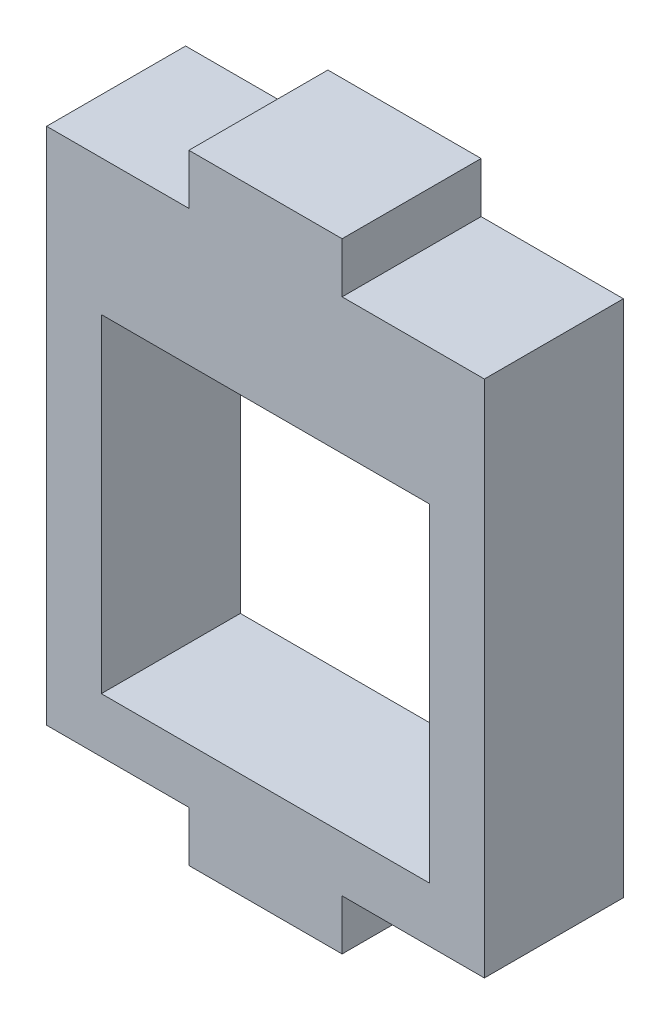
ISO-10303-21;
HEADER;
FILE_DESCRIPTION(('STEP AP214'),'2;1');
FILE_NAME('part.step','',(''),(''),'','','');
FILE_SCHEMA(('AUTOMOTIVE_DESIGN { 1 0 10303 214 1 1 1 1 }'));
ENDSEC;
DATA;
#1=APPLICATION_CONTEXT('core data for automotive mechanical design processes');
#2=APPLICATION_PROTOCOL_DEFINITION('international standard','automotive_design',2000,#1);
#3=PRODUCT_CONTEXT('',#1,'mechanical');
#4=PRODUCT('Part','Part','',(#3));
#5=PRODUCT_RELATED_PRODUCT_CATEGORY('part','',(#4));
#6=PRODUCT_DEFINITION_FORMATION('','',#4);
#7=PRODUCT_DEFINITION_CONTEXT('part definition',#1,'design');
#8=PRODUCT_DEFINITION('design','',#6,#7);
#9=PRODUCT_DEFINITION_SHAPE('','',#8);
#10=(LENGTH_UNIT() NAMED_UNIT(*) SI_UNIT(.MILLI.,.METRE.));
#11=(NAMED_UNIT(*) PLANE_ANGLE_UNIT() SI_UNIT($,.RADIAN.));
#12=(NAMED_UNIT(*) SI_UNIT($,.STERADIAN.) SOLID_ANGLE_UNIT());
#13=UNCERTAINTY_MEASURE_WITH_UNIT(LENGTH_MEASURE(1.E-05),#10,'distance_accuracy_value','');
#14=(GEOMETRIC_REPRESENTATION_CONTEXT(3) GLOBAL_UNCERTAINTY_ASSIGNED_CONTEXT((#13)) GLOBAL_UNIT_ASSIGNED_CONTEXT((#10,
#11,#12)) REPRESENTATION_CONTEXT('',''));
#15=CARTESIAN_POINT('',(0.,0.,0.));
#16=DIRECTION('',(0.,0.,1.));
#17=DIRECTION('',(1.,0.,0.));
#18=AXIS2_PLACEMENT_3D('',#15,#16,#17);
#19=CARTESIAN_POINT('',(2.26470070803342,0.383619426620352,6.35));
#20=DIRECTION('',(0.,1.,0.));
#21=DIRECTION('',(-1.,0.,0.));
#22=AXIS2_PLACEMENT_3D('',#19,#20,#21);
#23=PLANE('',#22);
#24=DIRECTION('',(0.,0.,1.));
#25=VECTOR('',#24,1.);
#26=CARTESIAN_POINT('',(-4.23529929196658,0.383619426620351,0.));
#27=LINE('',#26,#25);
#28=CARTESIAN_POINT('',(-4.23529929196658,0.383619426620351,0.));
#29=VERTEX_POINT('',#28);
#30=CARTESIAN_POINT('',(-4.23529929196658,0.383619426620351,6.35));
#31=VERTEX_POINT('',#30);
#32=EDGE_CURVE('E361',#29,#31,#27,.T.);
#33=ORIENTED_EDGE('',*,*,#32,.F.);
#34=DIRECTION('',(1.,0.,0.));
#35=VECTOR('',#34,1.);
#36=CARTESIAN_POINT('',(2.26470070803342,0.383619426620352,0.));
#37=LINE('',#36,#35);
#38=CARTESIAN_POINT('',(2.26470070803342,0.383619426620352,0.));
#39=VERTEX_POINT('',#38);
#40=EDGE_CURVE('E143',#29,#39,#37,.T.);
#41=ORIENTED_EDGE('',*,*,#40,.T.);
#42=DIRECTION('',(0.,0.,-1.));
#43=VECTOR('',#42,1.);
#44=CARTESIAN_POINT('',(2.26470070803342,0.383619426620352,6.35));
#45=LINE('',#44,#43);
#46=CARTESIAN_POINT('',(2.26470070803342,0.383619426620352,6.35));
#47=VERTEX_POINT('',#46);
#48=EDGE_CURVE('E48',#47,#39,#45,.T.);
#49=ORIENTED_EDGE('',*,*,#48,.F.);
#50=DIRECTION('',(1.,0.,0.));
#51=VECTOR('',#50,1.);
#52=CARTESIAN_POINT('',(2.26470070803342,0.383619426620352,6.35));
#53=LINE('',#52,#51);
#54=EDGE_CURVE('E266',#31,#47,#53,.T.);
#55=ORIENTED_EDGE('',*,*,#54,.F.);
#56=EDGE_LOOP('',(#33,#41,#49,#55));
#57=FACE_BOUND('',#56,.T.);
#58=ADVANCED_FACE('F39',(#57),#23,.F.);
#59=CARTESIAN_POINT('',(-17.7352992919666,0.383619426620351,6.35));
#60=DIRECTION('',(1.,0.,0.));
#61=DIRECTION('',(0.,0.,-1.));
#62=AXIS2_PLACEMENT_3D('',#59,#60,#61);
#63=PLANE('',#62);
#64=DIRECTION('',(0.,-1.,0.));
#65=VECTOR('',#64,1.);
#66=CARTESIAN_POINT('',(-17.7352992919666,0.383619426620351,0.));
#67=LINE('',#66,#65);
#68=CARTESIAN_POINT('',(-17.7352992919666,24.0836194266204,0.));
#69=VERTEX_POINT('',#68);
#70=CARTESIAN_POINT('',(-17.7352992919666,0.383619426620351,0.));
#71=VERTEX_POINT('',#70);
#72=EDGE_CURVE('E140',#69,#71,#67,.T.);
#73=ORIENTED_EDGE('',*,*,#72,.T.);
#74=DIRECTION('',(0.,0.,-1.));
#75=VECTOR('',#74,1.);
#76=CARTESIAN_POINT('',(-17.7352992919666,0.383619426620351,6.35));
#77=LINE('',#76,#75);
#78=CARTESIAN_POINT('',(-17.7352992919666,0.383619426620351,6.35));
#79=VERTEX_POINT('',#78);
#80=EDGE_CURVE('E11',#79,#71,#77,.T.);
#81=ORIENTED_EDGE('',*,*,#80,.F.);
#82=DIRECTION('',(0.,-1.,0.));
#83=VECTOR('',#82,1.);
#84=CARTESIAN_POINT('',(-17.7352992919666,0.383619426620351,6.35));
#85=LINE('',#84,#83);
#86=CARTESIAN_POINT('',(-17.7352992919666,24.0836194266204,6.35));
#87=VERTEX_POINT('',#86);
#88=EDGE_CURVE('E97',#87,#79,#85,.T.);
#89=ORIENTED_EDGE('',*,*,#88,.F.);
#90=DIRECTION('',(0.,0.,1.));
#91=VECTOR('',#90,1.);
#92=CARTESIAN_POINT('',(-17.7352992919666,24.0836194266204,0.));
#93=LINE('',#92,#91);
#94=EDGE_CURVE('E237',#69,#87,#93,.T.);
#95=ORIENTED_EDGE('',*,*,#94,.F.);
#96=EDGE_LOOP('',(#73,#81,#89,#95));
#97=FACE_BOUND('',#96,.T.);
#98=ADVANCED_FACE('F41',(#97),#63,.F.);
#99=CARTESIAN_POINT('',(-11.2352992919666,0.383619426620351,0.));
#100=VERTEX_POINT('',#99);
#101=EDGE_CURVE('E144',#71,#100,#37,.T.);
#102=ORIENTED_EDGE('',*,*,#101,.T.);
#103=DIRECTION('',(0.,0.,1.));
#104=VECTOR('',#103,1.);
#105=CARTESIAN_POINT('',(-11.2352992919666,0.383619426620351,0.));
#106=LINE('',#105,#104);
#107=CARTESIAN_POINT('',(-11.2352992919666,0.383619426620351,6.35));
#108=VERTEX_POINT('',#107);
#109=EDGE_CURVE('E226',#100,#108,#106,.T.);
#110=ORIENTED_EDGE('',*,*,#109,.T.);
#111=EDGE_CURVE('E267',#79,#108,#53,.T.);
#112=ORIENTED_EDGE('',*,*,#111,.F.);
#113=ORIENTED_EDGE('',*,*,#80,.T.);
#114=EDGE_LOOP('',(#102,#110,#112,#113));
#115=FACE_BOUND('',#114,.T.);
#116=ADVANCED_FACE('F369',(#115),#23,.F.);
#117=CARTESIAN_POINT('',(2.26470070803342,17.8836194266204,6.35));
#118=DIRECTION('',(-1.,0.,0.));
#119=DIRECTION('',(0.,-1.,0.));
#120=AXIS2_PLACEMENT_3D('',#117,#118,#119);
#121=PLANE('',#120);
#122=DIRECTION('',(0.,1.,0.));
#123=VECTOR('',#122,1.);
#124=CARTESIAN_POINT('',(2.26470070803342,17.8836194266204,0.));
#125=LINE('',#124,#123);
#126=CARTESIAN_POINT('',(2.26470070803342,24.0836194266204,0.));
#127=VERTEX_POINT('',#126);
#128=EDGE_CURVE('E148',#39,#127,#125,.T.);
#129=ORIENTED_EDGE('',*,*,#128,.T.);
#130=DIRECTION('',(0.,0.,1.));
#131=VECTOR('',#130,1.);
#132=CARTESIAN_POINT('',(2.26470070803342,24.0836194266204,0.));
#133=LINE('',#132,#131);
#134=CARTESIAN_POINT('',(2.26470070803342,24.0836194266204,6.35));
#135=VERTEX_POINT('',#134);
#136=EDGE_CURVE('E220',#127,#135,#133,.T.);
#137=ORIENTED_EDGE('',*,*,#136,.T.);
#138=DIRECTION('',(0.,1.,0.));
#139=VECTOR('',#138,1.);
#140=CARTESIAN_POINT('',(2.26470070803342,17.8836194266204,6.35));
#141=LINE('',#140,#139);
#142=EDGE_CURVE('E119',#47,#135,#141,.T.);
#143=ORIENTED_EDGE('',*,*,#142,.F.);
#144=ORIENTED_EDGE('',*,*,#48,.T.);
#145=EDGE_LOOP('',(#129,#137,#143,#144));
#146=FACE_BOUND('',#145,.T.);
#147=ADVANCED_FACE('F170',(#146),#121,.F.);
#148=CARTESIAN_POINT('',(-0.235299291966581,2.88361942662035,6.35));
#149=DIRECTION('',(1.,0.,0.));
#150=DIRECTION('',(0.,0.,-1.));
#151=AXIS2_PLACEMENT_3D('',#148,#149,#150);
#152=PLANE('',#151);
#153=DIRECTION('',(0.,-1.,0.));
#154=VECTOR('',#153,1.);
#155=CARTESIAN_POINT('',(-0.235299291966581,2.88361942662035,0.));
#156=LINE('',#155,#154);
#157=CARTESIAN_POINT('',(-0.235299291966581,17.8836194266204,0.));
#158=VERTEX_POINT('',#157);
#159=CARTESIAN_POINT('',(-0.235299291966581,2.88361942662035,0.));
#160=VERTEX_POINT('',#159);
#161=EDGE_CURVE('E125',#158,#160,#156,.T.);
#162=ORIENTED_EDGE('',*,*,#161,.T.);
#163=DIRECTION('',(0.,0.,-1.));
#164=VECTOR('',#163,1.);
#165=CARTESIAN_POINT('',(-0.235299291966581,2.88361942662035,6.35));
#166=LINE('',#165,#164);
#167=CARTESIAN_POINT('',(-0.235299291966581,2.88361942662035,6.35));
#168=VERTEX_POINT('',#167);
#169=EDGE_CURVE('E122',#168,#160,#166,.T.);
#170=ORIENTED_EDGE('',*,*,#169,.F.);
#171=DIRECTION('',(0.,-1.,0.));
#172=VECTOR('',#171,1.);
#173=CARTESIAN_POINT('',(-0.235299291966581,2.88361942662035,6.35));
#174=LINE('',#173,#172);
#175=CARTESIAN_POINT('',(-0.235299291966581,17.8836194266204,6.35));
#176=VERTEX_POINT('',#175);
#177=EDGE_CURVE('E107',#176,#168,#174,.T.);
#178=ORIENTED_EDGE('',*,*,#177,.F.);
#179=DIRECTION('',(0.,0.,-1.));
#180=VECTOR('',#179,1.);
#181=CARTESIAN_POINT('',(-0.235299291966581,17.8836194266204,6.35));
#182=LINE('',#181,#180);
#183=EDGE_CURVE('E129',#176,#158,#182,.T.);
#184=ORIENTED_EDGE('',*,*,#183,.T.);
#185=EDGE_LOOP('',(#162,#170,#178,#184));
#186=FACE_BOUND('',#185,.T.);
#187=ADVANCED_FACE('F123',(#186),#152,.F.);
#188=CARTESIAN_POINT('',(-15.2352992919666,2.88361942662035,6.35));
#189=DIRECTION('',(0.,-1.,0.));
#190=DIRECTION('',(1.,0.,0.));
#191=AXIS2_PLACEMENT_3D('',#188,#189,#190);
#192=PLANE('',#191);
#193=DIRECTION('',(-1.,0.,0.));
#194=VECTOR('',#193,1.);
#195=CARTESIAN_POINT('',(-15.2352992919666,2.88361942662035,0.));
#196=LINE('',#195,#194);
#197=CARTESIAN_POINT('',(-15.2352992919666,2.88361942662035,0.));
#198=VERTEX_POINT('',#197);
#199=EDGE_CURVE('E154',#160,#198,#196,.T.);
#200=ORIENTED_EDGE('',*,*,#199,.T.);
#201=DIRECTION('',(0.,0.,-1.));
#202=VECTOR('',#201,1.);
#203=CARTESIAN_POINT('',(-15.2352992919666,2.88361942662035,6.35));
#204=LINE('',#203,#202);
#205=CARTESIAN_POINT('',(-15.2352992919666,2.88361942662035,6.35));
#206=VERTEX_POINT('',#205);
#207=EDGE_CURVE('E130',#206,#198,#204,.T.);
#208=ORIENTED_EDGE('',*,*,#207,.F.);
#209=DIRECTION('',(-1.,0.,0.));
#210=VECTOR('',#209,1.);
#211=CARTESIAN_POINT('',(-15.2352992919666,2.88361942662035,6.35));
#212=LINE('',#211,#210);
#213=EDGE_CURVE('E111',#168,#206,#212,.T.);
#214=ORIENTED_EDGE('',*,*,#213,.F.);
#215=ORIENTED_EDGE('',*,*,#169,.T.);
#216=EDGE_LOOP('',(#200,#208,#214,#215));
#217=FACE_BOUND('',#216,.T.);
#218=ADVANCED_FACE('F132',(#217),#192,.F.);
#219=CARTESIAN_POINT('',(-15.2352992919666,17.8836194266204,6.35));
#220=DIRECTION('',(-1.,0.,0.));
#221=DIRECTION('',(0.,-1.,0.));
#222=AXIS2_PLACEMENT_3D('',#219,#220,#221);
#223=PLANE('',#222);
#224=DIRECTION('',(0.,1.,0.));
#225=VECTOR('',#224,1.);
#226=CARTESIAN_POINT('',(-15.2352992919666,17.8836194266204,0.));
#227=LINE('',#226,#225);
#228=CARTESIAN_POINT('',(-15.2352992919666,17.8836194266204,0.));
#229=VERTEX_POINT('',#228);
#230=EDGE_CURVE('E88',#198,#229,#227,.T.);
#231=ORIENTED_EDGE('',*,*,#230,.T.);
#232=DIRECTION('',(0.,0.,-1.));
#233=VECTOR('',#232,1.);
#234=CARTESIAN_POINT('',(-15.2352992919666,17.8836194266204,6.35));
#235=LINE('',#234,#233);
#236=CARTESIAN_POINT('',(-15.2352992919666,17.8836194266204,6.35));
#237=VERTEX_POINT('',#236);
#238=EDGE_CURVE('E136',#237,#229,#235,.T.);
#239=ORIENTED_EDGE('',*,*,#238,.F.);
#240=DIRECTION('',(0.,1.,0.));
#241=VECTOR('',#240,1.);
#242=CARTESIAN_POINT('',(-15.2352992919666,17.8836194266204,6.35));
#243=LINE('',#242,#241);
#244=EDGE_CURVE('E64',#206,#237,#243,.T.);
#245=ORIENTED_EDGE('',*,*,#244,.F.);
#246=ORIENTED_EDGE('',*,*,#207,.T.);
#247=EDGE_LOOP('',(#231,#239,#245,#246));
#248=FACE_BOUND('',#247,.T.);
#249=ADVANCED_FACE('F399',(#248),#223,.F.);
#250=CARTESIAN_POINT('',(0.,0.,6.35));
#251=DIRECTION('',(0.,0.,-1.));
#252=DIRECTION('',(-1.,0.,0.));
#253=AXIS2_PLACEMENT_3D('',#250,#251,#252);
#254=PLANE('',#253);
#255=ORIENTED_EDGE('',*,*,#142,.T.);
#256=DIRECTION('',(-1.,0.,0.));
#257=VECTOR('',#256,1.);
#258=CARTESIAN_POINT('',(-4.23529929196658,24.0836194266204,6.35));
#259=LINE('',#258,#257);
#260=CARTESIAN_POINT('',(-4.23529929196658,24.0836194266204,6.35));
#261=VERTEX_POINT('',#260);
#262=EDGE_CURVE('E221',#135,#261,#259,.T.);
#263=ORIENTED_EDGE('',*,*,#262,.T.);
#264=DIRECTION('',(0.,1.,0.));
#265=VECTOR('',#264,1.);
#266=CARTESIAN_POINT('',(-4.23529929196658,24.0836194266204,6.35));
#267=LINE('',#266,#265);
#268=CARTESIAN_POINT('',(-4.23529929196658,26.3836194266203,6.35));
#269=VERTEX_POINT('',#268);
#270=EDGE_CURVE('E225',#261,#269,#267,.T.);
#271=ORIENTED_EDGE('',*,*,#270,.T.);
#272=DIRECTION('',(-1.,0.,0.));
#273=VECTOR('',#272,1.);
#274=CARTESIAN_POINT('',(-11.2352992919666,26.3836194266203,6.35));
#275=LINE('',#274,#273);
#276=CARTESIAN_POINT('',(-11.2352992919666,26.3836194266203,6.35));
#277=VERTEX_POINT('',#276);
#278=EDGE_CURVE('E230',#269,#277,#275,.T.);
#279=ORIENTED_EDGE('',*,*,#278,.T.);
#280=DIRECTION('',(0.,-1.,0.));
#281=VECTOR('',#280,1.);
#282=CARTESIAN_POINT('',(-11.2352992919666,24.0836194266204,6.35));
#283=LINE('',#282,#281);
#284=CARTESIAN_POINT('',(-11.2352992919666,24.0836194266204,6.35));
#285=VERTEX_POINT('',#284);
#286=EDGE_CURVE('E203',#277,#285,#283,.T.);
#287=ORIENTED_EDGE('',*,*,#286,.T.);
#288=DIRECTION('',(-1.,0.,0.));
#289=VECTOR('',#288,1.);
#290=CARTESIAN_POINT('',(-17.7352992919666,24.0836194266204,6.35));
#291=LINE('',#290,#289);
#292=EDGE_CURVE('E197',#285,#87,#291,.T.);
#293=ORIENTED_EDGE('',*,*,#292,.T.);
#294=ORIENTED_EDGE('',*,*,#88,.T.);
#295=ORIENTED_EDGE('',*,*,#111,.T.);
#296=DIRECTION('',(0.,-1.,0.));
#297=VECTOR('',#296,1.);
#298=CARTESIAN_POINT('',(-11.2352992919666,0.383619426620351,6.35));
#299=LINE('',#298,#297);
#300=CARTESIAN_POINT('',(-11.2352992919666,-1.91638057337965,6.35));
#301=VERTEX_POINT('',#300);
#302=EDGE_CURVE('E55',#108,#301,#299,.T.);
#303=ORIENTED_EDGE('',*,*,#302,.T.);
#304=DIRECTION('',(1.,0.,0.));
#305=VECTOR('',#304,1.);
#306=CARTESIAN_POINT('',(-11.2352992919666,-1.91638057337965,6.35));
#307=LINE('',#306,#305);
#308=CARTESIAN_POINT('',(-4.23529929196658,-1.91638057337965,6.35));
#309=VERTEX_POINT('',#308);
#310=EDGE_CURVE('E336',#301,#309,#307,.T.);
#311=ORIENTED_EDGE('',*,*,#310,.T.);
#312=DIRECTION('',(0.,1.,0.));
#313=VECTOR('',#312,1.);
#314=CARTESIAN_POINT('',(-4.23529929196658,0.383619426620351,6.35));
#315=LINE('',#314,#313);
#316=EDGE_CURVE('E348',#309,#31,#315,.T.);
#317=ORIENTED_EDGE('',*,*,#316,.T.);
#318=ORIENTED_EDGE('',*,*,#54,.T.);
#319=EDGE_LOOP('',(#255,#263,#271,#279,#287,#293,#294,#295,#303,#311,#317,#318));
#320=FACE_BOUND('',#319,.T.);
#321=ORIENTED_EDGE('',*,*,#244,.T.);
#322=DIRECTION('',(1.,0.,0.));
#323=VECTOR('',#322,1.);
#324=CARTESIAN_POINT('',(-17.7352992919666,17.8836194266204,6.35));
#325=LINE('',#324,#323);
#326=EDGE_CURVE('E114',#237,#176,#325,.T.);
#327=ORIENTED_EDGE('',*,*,#326,.T.);
#328=ORIENTED_EDGE('',*,*,#177,.T.);
#329=ORIENTED_EDGE('',*,*,#213,.T.);
#330=EDGE_LOOP('',(#321,#327,#328,#329));
#331=FACE_BOUND('',#330,.T.);
#332=ADVANCED_FACE('F109',(#320,#331),#254,.F.);
#333=CARTESIAN_POINT('',(0.,0.,0.));
#334=DIRECTION('',(0.,0.,-1.));
#335=DIRECTION('',(-1.,0.,0.));
#336=AXIS2_PLACEMENT_3D('',#333,#334,#335);
#337=PLANE('',#336);
#338=ORIENTED_EDGE('',*,*,#72,.F.);
#339=DIRECTION('',(-1.,0.,0.));
#340=VECTOR('',#339,1.);
#341=CARTESIAN_POINT('',(-17.7352992919666,24.0836194266204,0.));
#342=LINE('',#341,#340);
#343=CARTESIAN_POINT('',(-11.2352992919666,24.0836194266204,0.));
#344=VERTEX_POINT('',#343);
#345=EDGE_CURVE('E216',#344,#69,#342,.T.);
#346=ORIENTED_EDGE('',*,*,#345,.F.);
#347=DIRECTION('',(0.,-1.,0.));
#348=VECTOR('',#347,1.);
#349=CARTESIAN_POINT('',(-11.2352992919666,24.0836194266204,0.));
#350=LINE('',#349,#348);
#351=CARTESIAN_POINT('',(-11.2352992919666,26.3836194266203,0.));
#352=VERTEX_POINT('',#351);
#353=EDGE_CURVE('E212',#352,#344,#350,.T.);
#354=ORIENTED_EDGE('',*,*,#353,.F.);
#355=DIRECTION('',(-1.,0.,0.));
#356=VECTOR('',#355,1.);
#357=CARTESIAN_POINT('',(-11.2352992919666,26.3836194266203,0.));
#358=LINE('',#357,#356);
#359=CARTESIAN_POINT('',(-4.23529929196658,26.3836194266203,0.));
#360=VERTEX_POINT('',#359);
#361=EDGE_CURVE('E201',#360,#352,#358,.T.);
#362=ORIENTED_EDGE('',*,*,#361,.F.);
#363=DIRECTION('',(0.,1.,0.));
#364=VECTOR('',#363,1.);
#365=CARTESIAN_POINT('',(-4.23529929196658,24.0836194266204,0.));
#366=LINE('',#365,#364);
#367=CARTESIAN_POINT('',(-4.23529929196658,24.0836194266204,0.));
#368=VERTEX_POINT('',#367);
#369=EDGE_CURVE('E191',#368,#360,#366,.T.);
#370=ORIENTED_EDGE('',*,*,#369,.F.);
#371=DIRECTION('',(-1.,0.,0.));
#372=VECTOR('',#371,1.);
#373=CARTESIAN_POINT('',(-4.23529929196658,24.0836194266204,0.));
#374=LINE('',#373,#372);
#375=EDGE_CURVE('E187',#127,#368,#374,.T.);
#376=ORIENTED_EDGE('',*,*,#375,.F.);
#377=ORIENTED_EDGE('',*,*,#128,.F.);
#378=ORIENTED_EDGE('',*,*,#40,.F.);
#379=DIRECTION('',(0.,1.,0.));
#380=VECTOR('',#379,1.);
#381=CARTESIAN_POINT('',(-4.23529929196658,0.383619426620351,0.));
#382=LINE('',#381,#380);
#383=CARTESIAN_POINT('',(-4.23529929196658,-1.91638057337965,0.));
#384=VERTEX_POINT('',#383);
#385=EDGE_CURVE('E340',#384,#29,#382,.T.);
#386=ORIENTED_EDGE('',*,*,#385,.F.);
#387=DIRECTION('',(1.,0.,0.));
#388=VECTOR('',#387,1.);
#389=CARTESIAN_POINT('',(-11.2352992919666,-1.91638057337965,0.));
#390=LINE('',#389,#388);
#391=CARTESIAN_POINT('',(-11.2352992919666,-1.91638057337965,0.));
#392=VERTEX_POINT('',#391);
#393=EDGE_CURVE('E334',#392,#384,#390,.T.);
#394=ORIENTED_EDGE('',*,*,#393,.F.);
#395=DIRECTION('',(0.,-1.,0.));
#396=VECTOR('',#395,1.);
#397=CARTESIAN_POINT('',(-11.2352992919666,0.383619426620351,0.));
#398=LINE('',#397,#396);
#399=EDGE_CURVE('E343',#100,#392,#398,.T.);
#400=ORIENTED_EDGE('',*,*,#399,.F.);
#401=ORIENTED_EDGE('',*,*,#101,.F.);
#402=EDGE_LOOP('',(#338,#346,#354,#362,#370,#376,#377,#378,#386,#394,#400,#401));
#403=FACE_BOUND('',#402,.T.);
#404=DIRECTION('',(1.,0.,0.));
#405=VECTOR('',#404,1.);
#406=CARTESIAN_POINT('',(-17.7352992919666,17.8836194266204,0.));
#407=LINE('',#406,#405);
#408=EDGE_CURVE('E241',#229,#158,#407,.T.);
#409=ORIENTED_EDGE('',*,*,#408,.F.);
#410=ORIENTED_EDGE('',*,*,#230,.F.);
#411=ORIENTED_EDGE('',*,*,#199,.F.);
#412=ORIENTED_EDGE('',*,*,#161,.F.);
#413=EDGE_LOOP('',(#409,#410,#411,#412));
#414=FACE_BOUND('',#413,.T.);
#415=ADVANCED_FACE('F181',(#403,#414),#337,.T.);
#416=CARTESIAN_POINT('',(-17.7352992919666,17.8836194266204,6.35));
#417=DIRECTION('',(0.,1.,0.));
#418=DIRECTION('',(0.,0.,1.));
#419=AXIS2_PLACEMENT_3D('',#416,#417,#418);
#420=PLANE('',#419);
#421=ORIENTED_EDGE('',*,*,#408,.T.);
#422=ORIENTED_EDGE('',*,*,#183,.F.);
#423=ORIENTED_EDGE('',*,*,#326,.F.);
#424=ORIENTED_EDGE('',*,*,#238,.T.);
#425=EDGE_LOOP('',(#421,#422,#423,#424));
#426=FACE_BOUND('',#425,.T.);
#427=ADVANCED_FACE('F404',(#426),#420,.F.);
#428=CARTESIAN_POINT('',(-17.7352992919666,24.0836194266204,0.));
#429=DIRECTION('',(0.,1.,0.));
#430=DIRECTION('',(0.,0.,1.));
#431=AXIS2_PLACEMENT_3D('',#428,#429,#430);
#432=PLANE('',#431);
#433=ORIENTED_EDGE('',*,*,#292,.F.);
#434=DIRECTION('',(0.,0.,1.));
#435=VECTOR('',#434,1.);
#436=CARTESIAN_POINT('',(-11.2352992919666,24.0836194266204,0.));
#437=LINE('',#436,#435);
#438=EDGE_CURVE('E242',#344,#285,#437,.T.);
#439=ORIENTED_EDGE('',*,*,#438,.F.);
#440=ORIENTED_EDGE('',*,*,#345,.T.);
#441=ORIENTED_EDGE('',*,*,#94,.T.);
#442=EDGE_LOOP('',(#433,#439,#440,#441));
#443=FACE_BOUND('',#442,.T.);
#444=ADVANCED_FACE('F296',(#443),#432,.T.);
#445=CARTESIAN_POINT('',(-11.2352992919666,24.0836194266204,0.));
#446=DIRECTION('',(-1.,0.,0.));
#447=DIRECTION('',(0.,0.,1.));
#448=AXIS2_PLACEMENT_3D('',#445,#446,#447);
#449=PLANE('',#448);
#450=ORIENTED_EDGE('',*,*,#286,.F.);
#451=DIRECTION('',(0.,0.,1.));
#452=VECTOR('',#451,1.);
#453=CARTESIAN_POINT('',(-11.2352992919666,26.3836194266203,0.));
#454=LINE('',#453,#452);
#455=EDGE_CURVE('E246',#352,#277,#454,.T.);
#456=ORIENTED_EDGE('',*,*,#455,.F.);
#457=ORIENTED_EDGE('',*,*,#353,.T.);
#458=ORIENTED_EDGE('',*,*,#438,.T.);
#459=EDGE_LOOP('',(#450,#456,#457,#458));
#460=FACE_BOUND('',#459,.T.);
#461=ADVANCED_FACE('F302',(#460),#449,.T.);
#462=CARTESIAN_POINT('',(-11.2352992919666,26.3836194266203,0.));
#463=DIRECTION('',(0.,1.,0.));
#464=DIRECTION('',(0.,0.,1.));
#465=AXIS2_PLACEMENT_3D('',#462,#463,#464);
#466=PLANE('',#465);
#467=ORIENTED_EDGE('',*,*,#278,.F.);
#468=DIRECTION('',(0.,0.,1.));
#469=VECTOR('',#468,1.);
#470=CARTESIAN_POINT('',(-4.23529929196658,26.3836194266203,0.));
#471=LINE('',#470,#469);
#472=EDGE_CURVE('E250',#360,#269,#471,.T.);
#473=ORIENTED_EDGE('',*,*,#472,.F.);
#474=ORIENTED_EDGE('',*,*,#361,.T.);
#475=ORIENTED_EDGE('',*,*,#455,.T.);
#476=EDGE_LOOP('',(#467,#473,#474,#475));
#477=FACE_BOUND('',#476,.T.);
#478=ADVANCED_FACE('F371',(#477),#466,.T.);
#479=CARTESIAN_POINT('',(-4.23529929196658,24.0836194266204,0.));
#480=DIRECTION('',(1.,0.,0.));
#481=DIRECTION('',(0.,0.,-1.));
#482=AXIS2_PLACEMENT_3D('',#479,#480,#481);
#483=PLANE('',#482);
#484=ORIENTED_EDGE('',*,*,#270,.F.);
#485=DIRECTION('',(0.,0.,1.));
#486=VECTOR('',#485,1.);
#487=CARTESIAN_POINT('',(-4.23529929196658,24.0836194266204,0.));
#488=LINE('',#487,#486);
#489=EDGE_CURVE('E254',#368,#261,#488,.T.);
#490=ORIENTED_EDGE('',*,*,#489,.F.);
#491=ORIENTED_EDGE('',*,*,#369,.T.);
#492=ORIENTED_EDGE('',*,*,#472,.T.);
#493=EDGE_LOOP('',(#484,#490,#491,#492));
#494=FACE_BOUND('',#493,.T.);
#495=ADVANCED_FACE('F282',(#494),#483,.T.);
#496=CARTESIAN_POINT('',(-4.23529929196658,24.0836194266204,0.));
#497=DIRECTION('',(0.,1.,0.));
#498=DIRECTION('',(0.,0.,1.));
#499=AXIS2_PLACEMENT_3D('',#496,#497,#498);
#500=PLANE('',#499);
#501=ORIENTED_EDGE('',*,*,#262,.F.);
#502=ORIENTED_EDGE('',*,*,#136,.F.);
#503=ORIENTED_EDGE('',*,*,#375,.T.);
#504=ORIENTED_EDGE('',*,*,#489,.T.);
#505=EDGE_LOOP('',(#501,#502,#503,#504));
#506=FACE_BOUND('',#505,.T.);
#507=ADVANCED_FACE('F276',(#506),#500,.T.);
#508=CARTESIAN_POINT('',(-11.2352992919666,0.383619426620351,0.));
#509=DIRECTION('',(-1.,0.,0.));
#510=DIRECTION('',(0.,0.,1.));
#511=AXIS2_PLACEMENT_3D('',#508,#509,#510);
#512=PLANE('',#511);
#513=ORIENTED_EDGE('',*,*,#302,.F.);
#514=ORIENTED_EDGE('',*,*,#109,.F.);
#515=ORIENTED_EDGE('',*,*,#399,.T.);
#516=DIRECTION('',(0.,0.,1.));
#517=VECTOR('',#516,1.);
#518=CARTESIAN_POINT('',(-11.2352992919666,-1.91638057337965,0.));
#519=LINE('',#518,#517);
#520=EDGE_CURVE('E206',#392,#301,#519,.T.);
#521=ORIENTED_EDGE('',*,*,#520,.T.);
#522=EDGE_LOOP('',(#513,#514,#515,#521));
#523=FACE_BOUND('',#522,.T.);
#524=ADVANCED_FACE('F346',(#523),#512,.T.);
#525=CARTESIAN_POINT('',(-4.23529929196658,0.383619426620351,0.));
#526=DIRECTION('',(1.,0.,0.));
#527=DIRECTION('',(0.,0.,-1.));
#528=AXIS2_PLACEMENT_3D('',#525,#526,#527);
#529=PLANE('',#528);
#530=ORIENTED_EDGE('',*,*,#316,.F.);
#531=DIRECTION('',(0.,0.,1.));
#532=VECTOR('',#531,1.);
#533=CARTESIAN_POINT('',(-4.23529929196658,-1.91638057337965,0.));
#534=LINE('',#533,#532);
#535=EDGE_CURVE('E339',#384,#309,#534,.T.);
#536=ORIENTED_EDGE('',*,*,#535,.F.);
#537=ORIENTED_EDGE('',*,*,#385,.T.);
#538=ORIENTED_EDGE('',*,*,#32,.T.);
#539=EDGE_LOOP('',(#530,#536,#537,#538));
#540=FACE_BOUND('',#539,.T.);
#541=ADVANCED_FACE('F366',(#540),#529,.T.);
#542=CARTESIAN_POINT('',(-11.2352992919666,-1.91638057337965,0.));
#543=DIRECTION('',(0.,-1.,0.));
#544=DIRECTION('',(0.,0.,-1.));
#545=AXIS2_PLACEMENT_3D('',#542,#543,#544);
#546=PLANE('',#545);
#547=ORIENTED_EDGE('',*,*,#310,.F.);
#548=ORIENTED_EDGE('',*,*,#520,.F.);
#549=ORIENTED_EDGE('',*,*,#393,.T.);
#550=ORIENTED_EDGE('',*,*,#535,.T.);
#551=EDGE_LOOP('',(#547,#548,#549,#550));
#552=FACE_BOUND('',#551,.T.);
#553=ADVANCED_FACE('F333',(#552),#546,.T.);
#554=CLOSED_SHELL('',(#58,#98,#116,#147,#187,#218,#249,#332,#415,#427,#444,#461,#478,#495,#507,
#524,#541,#553));
#555=MANIFOLD_SOLID_BREP('B2',#554);
#556=ADVANCED_BREP_SHAPE_REPRESENTATION('',(#18,#555),#14);
#557=SHAPE_DEFINITION_REPRESENTATION(#9,#556);
ENDSEC;
END-ISO-10303-21;
